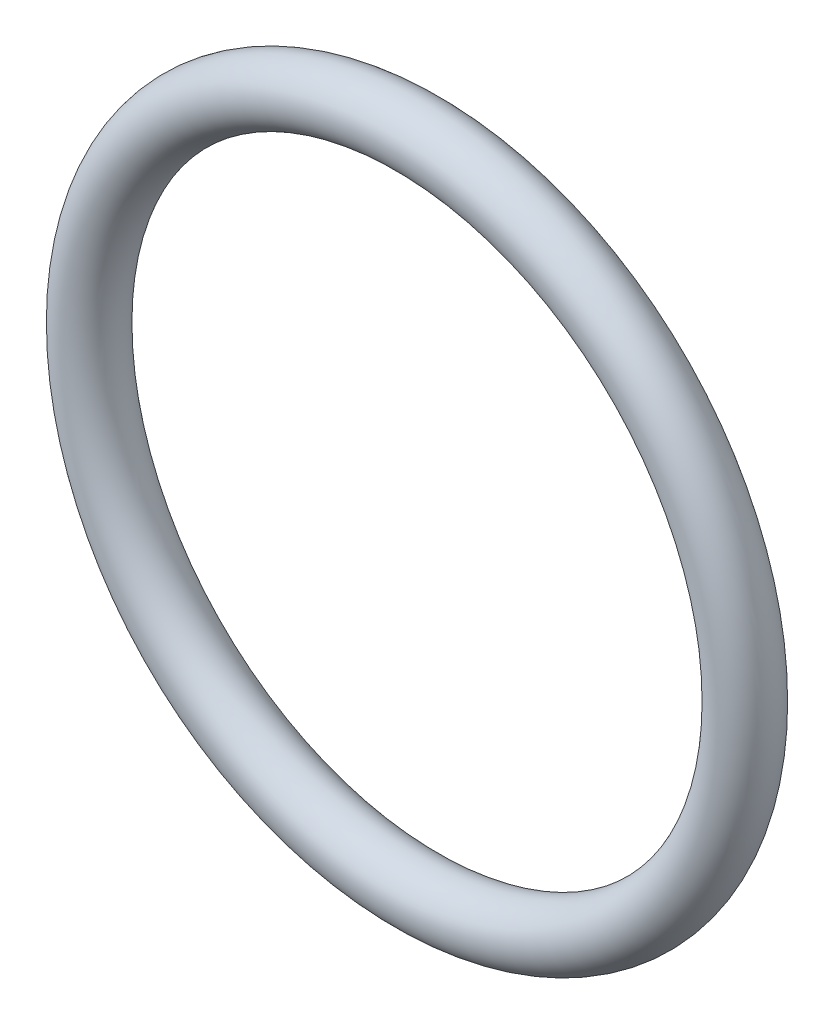
ISO-10303-21;
HEADER;
FILE_DESCRIPTION(('STEP AP214'),'2;1');
FILE_NAME('part.step','',(''),(''),'','','');
FILE_SCHEMA(('AUTOMOTIVE_DESIGN { 1 0 10303 214 1 1 1 1 }'));
ENDSEC;
DATA;
#1=APPLICATION_CONTEXT('core data for automotive mechanical design processes');
#2=APPLICATION_PROTOCOL_DEFINITION('international standard','automotive_design',2000,#1);
#3=PRODUCT_CONTEXT('',#1,'mechanical');
#4=PRODUCT('Part','Part','',(#3));
#5=PRODUCT_RELATED_PRODUCT_CATEGORY('part','',(#4));
#6=PRODUCT_DEFINITION_FORMATION('','',#4);
#7=PRODUCT_DEFINITION_CONTEXT('part definition',#1,'design');
#8=PRODUCT_DEFINITION('design','',#6,#7);
#9=PRODUCT_DEFINITION_SHAPE('','',#8);
#10=(LENGTH_UNIT() NAMED_UNIT(*) SI_UNIT(.MILLI.,.METRE.));
#11=(NAMED_UNIT(*) PLANE_ANGLE_UNIT() SI_UNIT($,.RADIAN.));
#12=(NAMED_UNIT(*) SI_UNIT($,.STERADIAN.) SOLID_ANGLE_UNIT());
#13=UNCERTAINTY_MEASURE_WITH_UNIT(LENGTH_MEASURE(1.E-05),#10,'distance_accuracy_value','');
#14=(GEOMETRIC_REPRESENTATION_CONTEXT(3) GLOBAL_UNCERTAINTY_ASSIGNED_CONTEXT((#13)) GLOBAL_UNIT_ASSIGNED_CONTEXT((#10,
#11,#12)) REPRESENTATION_CONTEXT('',''));
#15=CARTESIAN_POINT('',(0.,0.,0.));
#16=DIRECTION('',(0.,0.,1.));
#17=DIRECTION('',(1.,0.,0.));
#18=AXIS2_PLACEMENT_3D('',#15,#16,#17);
#19=CARTESIAN_POINT('',(0.,0.,0.));
#20=DIRECTION('',(0.,0.,-1.));
#21=DIRECTION('',(-1.,0.,0.));
#22=AXIS2_PLACEMENT_3D('',#19,#20,#21);
#23=TOROIDAL_SURFACE('',#22,16.25,1.5);
#24=CARTESIAN_POINT('',(-17.75,0.,0.));
#25=VERTEX_POINT('',#24);
#26=VERTEX_LOOP('',#25);
#27=FACE_BOUND('',#26,.T.);
#28=ADVANCED_FACE('F28',(#27),#23,.T.);
#29=CLOSED_SHELL('',(#28));
#30=MANIFOLD_SOLID_BREP('B2',#29);
#31=ADVANCED_BREP_SHAPE_REPRESENTATION('',(#18,#30),#14);
#32=SHAPE_DEFINITION_REPRESENTATION(#9,#31);
ENDSEC;
END-ISO-10303-21;
